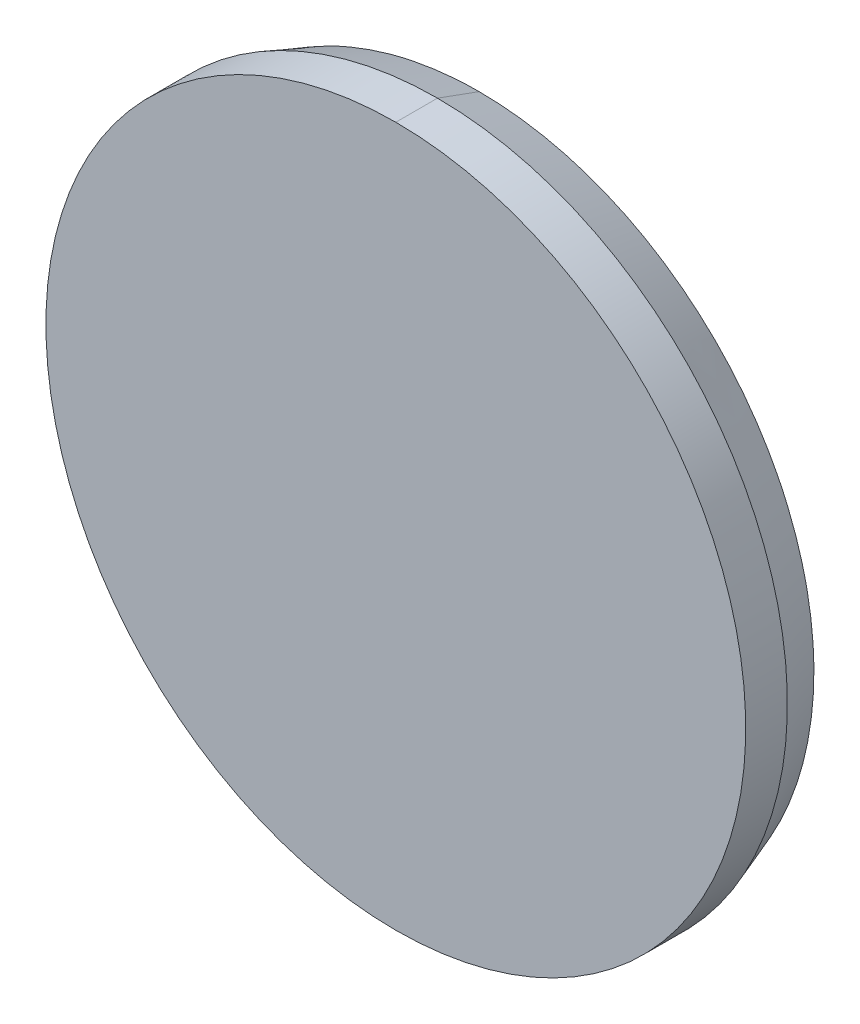
ISO-10303-21;
HEADER;
FILE_DESCRIPTION(('STEP AP214'),'2;1');
FILE_NAME('part.step','',(''),(''),'','','');
FILE_SCHEMA(('AUTOMOTIVE_DESIGN { 1 0 10303 214 1 1 1 1 }'));
ENDSEC;
DATA;
#1=APPLICATION_CONTEXT('core data for automotive mechanical design processes');
#2=APPLICATION_PROTOCOL_DEFINITION('international standard','automotive_design',2000,#1);
#3=PRODUCT_CONTEXT('',#1,'mechanical');
#4=PRODUCT('Part','Part','',(#3));
#5=PRODUCT_RELATED_PRODUCT_CATEGORY('part','',(#4));
#6=PRODUCT_DEFINITION_FORMATION('','',#4);
#7=PRODUCT_DEFINITION_CONTEXT('part definition',#1,'design');
#8=PRODUCT_DEFINITION('design','',#6,#7);
#9=PRODUCT_DEFINITION_SHAPE('','',#8);
#10=(LENGTH_UNIT() NAMED_UNIT(*) SI_UNIT(.MILLI.,.METRE.));
#11=(NAMED_UNIT(*) PLANE_ANGLE_UNIT() SI_UNIT($,.RADIAN.));
#12=(NAMED_UNIT(*) SI_UNIT($,.STERADIAN.) SOLID_ANGLE_UNIT());
#13=UNCERTAINTY_MEASURE_WITH_UNIT(LENGTH_MEASURE(1.E-05),#10,'distance_accuracy_value','');
#14=(GEOMETRIC_REPRESENTATION_CONTEXT(3) GLOBAL_UNCERTAINTY_ASSIGNED_CONTEXT((#13)) GLOBAL_UNIT_ASSIGNED_CONTEXT((#10,
#11,#12)) REPRESENTATION_CONTEXT('',''));
#15=CARTESIAN_POINT('',(0.,0.,0.));
#16=DIRECTION('',(0.,0.,1.));
#17=DIRECTION('',(1.,0.,0.));
#18=AXIS2_PLACEMENT_3D('',#15,#16,#17);
#19=CARTESIAN_POINT('',(30.25,-84.5,-139.));
#20=DIRECTION('',(0.,0.,-1.));
#21=DIRECTION('',(0.,-1.,0.));
#22=AXIS2_PLACEMENT_3D('',#19,#20,#21);
#23=PLANE('',#22);
#24=CARTESIAN_POINT('',(30.25,-84.5,-139.));
#25=DIRECTION('',(0.,0.,-1.));
#26=DIRECTION('',(0.,1.,0.));
#27=AXIS2_PLACEMENT_3D('',#24,#25,#26);
#28=CIRCLE('',#27,21.);
#29=CARTESIAN_POINT('',(30.25,-63.5,-139.));
#30=VERTEX_POINT('',#29);
#31=CARTESIAN_POINT('',(30.25,-105.5,-139.));
#32=VERTEX_POINT('',#31);
#33=EDGE_CURVE('E54',#30,#32,#28,.T.);
#34=ORIENTED_EDGE('',*,*,#33,.F.);
#35=CARTESIAN_POINT('',(30.25,-84.5,-139.));
#36=DIRECTION('',(0.,0.,-1.));
#37=DIRECTION('',(0.,-1.,0.));
#38=AXIS2_PLACEMENT_3D('',#35,#36,#37);
#39=CIRCLE('',#38,21.);
#40=EDGE_CURVE('E52',#32,#30,#39,.T.);
#41=ORIENTED_EDGE('',*,*,#40,.F.);
#42=EDGE_LOOP('',(#34,#41));
#43=FACE_BOUND('',#42,.T.);
#44=ADVANCED_FACE('F17',(#43),#23,.F.);
#45=CARTESIAN_POINT('',(30.25,-84.5,-78.375));
#46=DIRECTION('',(0.,0.,-1.));
#47=DIRECTION('',(0.,-1.,0.));
#48=AXIS2_PLACEMENT_3D('',#45,#46,#47);
#49=CYLINDRICAL_SURFACE('',#48,21.);
#50=ORIENTED_EDGE('',*,*,#33,.T.);
#51=CARTESIAN_POINT('',(30.25,-105.5,-141.5));
#52=DIRECTION('',(0.,0.,1.));
#53=VECTOR('',#52,1.);
#54=LINE('',#51,#53);
#55=CARTESIAN_POINT('',(30.25,-105.500000000001,-141.5));
#56=VERTEX_POINT('',#55);
#57=EDGE_CURVE('E74',#56,#32,#54,.T.);
#58=ORIENTED_EDGE('',*,*,#57,.F.);
#59=CARTESIAN_POINT('',(30.25,-84.5,-141.500000000001));
#60=DIRECTION('',(0.,0.,-1.));
#61=DIRECTION('',(0.,1.,0.));
#62=AXIS2_PLACEMENT_3D('',#59,#60,#61);
#63=CIRCLE('',#62,21.0000000000024);
#64=CARTESIAN_POINT('',(30.25,-63.4999999999988,-141.5));
#65=VERTEX_POINT('',#64);
#66=EDGE_CURVE('E67',#65,#56,#63,.T.);
#67=ORIENTED_EDGE('',*,*,#66,.F.);
#68=CARTESIAN_POINT('',(30.25,-63.5,-139.));
#69=DIRECTION('',(0.,0.,-1.));
#70=VECTOR('',#69,1.);
#71=LINE('',#68,#70);
#72=EDGE_CURVE('E64',#30,#65,#71,.T.);
#73=ORIENTED_EDGE('',*,*,#72,.F.);
#74=EDGE_LOOP('',(#50,#58,#67,#73));
#75=FACE_BOUND('',#74,.T.);
#76=ADVANCED_FACE('F66',(#75),#49,.T.);
#77=CARTESIAN_POINT('',(30.25,-84.5,-78.375));
#78=DIRECTION('',(0.,0.,-1.));
#79=DIRECTION('',(0.,-1.,0.));
#80=AXIS2_PLACEMENT_3D('',#77,#78,#79);
#81=CYLINDRICAL_SURFACE('',#80,21.);
#82=CARTESIAN_POINT('',(30.25,-84.5,-141.500000000001));
#83=DIRECTION('',(0.,0.,-1.));
#84=DIRECTION('',(0.,-1.,0.));
#85=AXIS2_PLACEMENT_3D('',#82,#83,#84);
#86=CIRCLE('',#85,21.0000000000024);
#87=EDGE_CURVE('E131',#56,#65,#86,.T.);
#88=ORIENTED_EDGE('',*,*,#87,.F.);
#89=ORIENTED_EDGE('',*,*,#57,.T.);
#90=ORIENTED_EDGE('',*,*,#40,.T.);
#91=ORIENTED_EDGE('',*,*,#72,.T.);
#92=EDGE_LOOP('',(#88,#89,#90,#91));
#93=FACE_BOUND('',#92,.T.);
#94=ADVANCED_FACE('F78',(#93),#81,.T.);
#95=CARTESIAN_POINT('',(30.25,-84.5,-142.75));
#96=DIRECTION('',(0.,0.,1.));
#97=DIRECTION('',(0.,1.,0.));
#98=AXIS2_PLACEMENT_3D('',#95,#96,#97);
#99=CONICAL_SURFACE('',#98,20.54503720717,0.3490658503988);
#100=ORIENTED_EDGE('',*,*,#66,.T.);
#101=CARTESIAN_POINT('',(30.25,-104.590074414333,-144.000000000012));
#102=DIRECTION('',(0.,-0.342020143325605,0.939692620785932));
#103=VECTOR('',#102,1.);
#104=LINE('',#101,#103);
#105=CARTESIAN_POINT('',(30.25,-104.590074414333,-144.000000000005));
#106=VERTEX_POINT('',#105);
#107=EDGE_CURVE('E37',#106,#56,#104,.T.);
#108=ORIENTED_EDGE('',*,*,#107,.F.);
#109=CARTESIAN_POINT('',(30.25,-64.40992558567,-144.));
#110=CARTESIAN_POINT('',(32.2284219167146,-64.40992558567,-144.));
#111=CARTESIAN_POINT('',(34.1693790868196,-64.7959507322196,-144.));
#112=CARTESIAN_POINT('',(36.1095296828903,-65.1818154641734,-144.));
#113=CARTESIAN_POINT('',(37.9381386333459,-65.9391914419719,-144.));
#114=CARTESIAN_POINT('',(39.7657313049657,-66.6961464958889,-144.));
#115=CARTESIAN_POINT('',(41.4114473237505,-67.7957136155878,-144.));
#116=CARTESIAN_POINT('',(43.0562487093553,-68.8946696331525,-144.));
#117=CARTESIAN_POINT('',(44.4558278529151,-70.2941721470849,-144.));
#118=CARTESIAN_POINT('',(45.8546291577585,-71.692896864889,-144.));
#119=CARTESIAN_POINT('',(46.9542863844122,-73.3385526762495,-144.));
#120=CARTESIAN_POINT('',(48.0533324587547,-74.9832938877436,-144.));
#121=CARTESIAN_POINT('',(48.8108085580281,-76.8118613666541,-144.));
#122=CARTESIAN_POINT('',(49.5678636776826,-78.6394125895516,-144.));
#123=CARTESIAN_POINT('',(49.9540492677804,-80.5806209131804,-144.));
#124=CARTESIAN_POINT('',(50.3400202290081,-82.520750378975,-144.));
#125=CARTESIAN_POINT('',(50.34007441433,-84.5,-144.));
#126=CARTESIAN_POINT('',(50.3401285695376,-86.4781496212056,-144.));
#127=CARTESIAN_POINT('',(49.9540492677804,-88.4193790868196,-144.));
#128=CARTESIAN_POINT('',(49.5681845358134,-90.359529682893,-144.));
#129=CARTESIAN_POINT('',(48.8108085580281,-92.1881386333459,-144.));
#130=CARTESIAN_POINT('',(48.0538535041433,-94.0157313049172,-144.));
#131=CARTESIAN_POINT('',(46.9542863844122,-95.6614473237505,-144.));
#132=CARTESIAN_POINT('',(45.8553303667979,-97.3062487094299,-144.));
#133=CARTESIAN_POINT('',(44.4558278529151,-98.7058278529151,-144.));
#134=CARTESIAN_POINT('',(43.0571031350609,-100.104629157784,-144.));
#135=CARTESIAN_POINT('',(41.4114473237505,-101.204286384412,-144.));
#136=CARTESIAN_POINT('',(39.7667061122893,-102.303332458741,-144.));
#137=CARTESIAN_POINT('',(37.9381386333459,-103.060808558028,-144.));
#138=CARTESIAN_POINT('',(36.1105874104599,-103.817863677678,-144.));
#139=CARTESIAN_POINT('',(34.1693790868196,-104.20404926778,-144.));
#140=CARTESIAN_POINT('',(32.2289772519988,-104.59007441433,-144.));
#141=CARTESIAN_POINT('',(30.25,-104.59007441433,-144.));
#142=B_SPLINE_CURVE_WITH_KNOTS('',2,(#109,#110,#111,#112,#113,#114,#115,#116,#117,#118,#119,
#120,#121,#122,#123,#124,#125,#126,#127,#128,#129,#130,#131,#132,#133,#134,#135,#136,#137,#138,
#139,#140,#141),.UNSPECIFIED.,.F.,.F.,(3,2,2,2,2,2,2,2,2,2,2,2,2,2,2,2,3),(0.,0.0625,0.125,
0.1875,0.25,0.3125,0.375,0.4375,0.5,0.5625,0.625,0.6875,0.75,0.8125,0.875,0.9375,1.),.UNSPECIFIED.);
#143=CARTESIAN_POINT('',(30.25,-64.4099255856657,-144.000000000002));
#144=VERTEX_POINT('',#143);
#145=EDGE_CURVE('E29',#144,#106,#142,.T.);
#146=ORIENTED_EDGE('',*,*,#145,.F.);
#147=CARTESIAN_POINT('',(30.25,-63.4999999999977,-141.500000000001));
#148=DIRECTION('',(0.,-0.342020143325608,-0.939692620785931));
#149=VECTOR('',#148,1.);
#150=LINE('',#147,#149);
#151=EDGE_CURVE('E136',#65,#144,#150,.T.);
#152=ORIENTED_EDGE('',*,*,#151,.F.);
#153=EDGE_LOOP('',(#100,#108,#146,#152));
#154=FACE_BOUND('',#153,.T.);
#155=ADVANCED_FACE('F97',(#154),#99,.T.);
#156=CARTESIAN_POINT('',(30.25,-84.5,-142.75));
#157=DIRECTION('',(0.,0.,1.));
#158=DIRECTION('',(0.,1.,0.));
#159=AXIS2_PLACEMENT_3D('',#156,#157,#158);
#160=CONICAL_SURFACE('',#159,20.54503720717,0.3490658503988);
#161=CARTESIAN_POINT('',(30.25,-104.59007441433,-144.));
#162=CARTESIAN_POINT('',(28.2715780831724,-104.59007441433,-144.));
#163=CARTESIAN_POINT('',(26.3306209131804,-104.20404926778,-144.));
#164=CARTESIAN_POINT('',(24.3904703170654,-103.818184535795,-144.));
#165=CARTESIAN_POINT('',(22.5618613666541,-103.060808558028,-144.));
#166=CARTESIAN_POINT('',(20.7342686950688,-102.303853504138,-144.));
#167=CARTESIAN_POINT('',(19.0885526762495,-101.204286384412,-144.));
#168=CARTESIAN_POINT('',(17.4437512906321,-100.105330366835,-144.));
#169=CARTESIAN_POINT('',(16.0441721470849,-98.7058278529151,-144.));
#170=CARTESIAN_POINT('',(14.6453708422737,-97.3071031351432,-144.));
#171=CARTESIAN_POINT('',(13.5457136155878,-95.6614473237505,-144.));
#172=CARTESIAN_POINT('',(12.4466675412124,-94.0167061122233,-144.));
#173=CARTESIAN_POINT('',(11.6891914419719,-92.1881386333459,-144.));
#174=CARTESIAN_POINT('',(10.9321363223187,-90.3605874104053,-144.));
#175=CARTESIAN_POINT('',(10.5459507322196,-88.4193790868196,-144.));
#176=CARTESIAN_POINT('',(10.1599797709981,-86.4792496211057,-144.));
#177=CARTESIAN_POINT('',(10.15992558567,-84.5,-144.));
#178=CARTESIAN_POINT('',(10.1598714304562,-82.5218503788707,-144.));
#179=CARTESIAN_POINT('',(10.5459507322196,-80.5806209131804,-144.));
#180=CARTESIAN_POINT('',(10.9318154641691,-78.6404703171503,-144.));
#181=CARTESIAN_POINT('',(11.6891914419719,-76.8118613666541,-144.));
#182=CARTESIAN_POINT('',(12.446146495856,-74.9842686950835,-144.));
#183=CARTESIAN_POINT('',(13.5457136155878,-73.3385526762495,-144.));
#184=CARTESIAN_POINT('',(14.6446696331274,-71.6937512906823,-144.));
#185=CARTESIAN_POINT('',(16.0441721470849,-70.2941721470849,-144.));
#186=CARTESIAN_POINT('',(17.442896864813,-68.8953708423051,-144.));
#187=CARTESIAN_POINT('',(19.0885526762495,-67.7957136155878,-144.));
#188=CARTESIAN_POINT('',(20.7332938877338,-66.6966675412391,-144.));
#189=CARTESIAN_POINT('',(22.5618613666541,-65.9391914419719,-144.));
#190=CARTESIAN_POINT('',(24.389412589548,-65.1821363223292,-144.));
#191=CARTESIAN_POINT('',(26.3306209131804,-64.7959507322196,-144.));
#192=CARTESIAN_POINT('',(28.2710227479582,-64.40992558567,-144.));
#193=CARTESIAN_POINT('',(30.25,-64.40992558567,-144.));
#194=B_SPLINE_CURVE_WITH_KNOTS('',2,(#161,#162,#163,#164,#165,#166,#167,#168,#169,#170,#171,
#172,#173,#174,#175,#176,#177,#178,#179,#180,#181,#182,#183,#184,#185,#186,#187,#188,#189,#190,
#191,#192,#193),.UNSPECIFIED.,.F.,.F.,(3,2,2,2,2,2,2,2,2,2,2,2,2,2,2,2,3),(0.,0.0625,0.125,
0.1875,0.25,0.3125,0.375,0.4375,0.5,0.5625,0.625,0.6875,0.75,0.8125,0.875,0.9375,1.),.UNSPECIFIED.);
#195=EDGE_CURVE('E11',#106,#144,#194,.T.);
#196=ORIENTED_EDGE('',*,*,#195,.F.);
#197=ORIENTED_EDGE('',*,*,#107,.T.);
#198=ORIENTED_EDGE('',*,*,#87,.T.);
#199=ORIENTED_EDGE('',*,*,#151,.T.);
#200=EDGE_LOOP('',(#196,#197,#198,#199));
#201=FACE_BOUND('',#200,.T.);
#202=ADVANCED_FACE('F143',(#201),#160,.T.);
#203=CARTESIAN_POINT('',(30.25,-84.5,-144.));
#204=DIRECTION('',(0.,0.,-1.));
#205=DIRECTION('',(0.,-1.,0.));
#206=AXIS2_PLACEMENT_3D('',#203,#204,#205);
#207=PLANE('',#206);
#208=ORIENTED_EDGE('',*,*,#145,.T.);
#209=ORIENTED_EDGE('',*,*,#195,.T.);
#210=EDGE_LOOP('',(#208,#209));
#211=FACE_BOUND('',#210,.T.);
#212=ADVANCED_FACE('F163',(#211),#207,.T.);
#213=CLOSED_SHELL('',(#44,#76,#94,#155,#202,#212));
#214=MANIFOLD_SOLID_BREP('B1',#213);
#215=ADVANCED_BREP_SHAPE_REPRESENTATION('',(#18,#214),#14);
#216=SHAPE_DEFINITION_REPRESENTATION(#9,#215);
ENDSEC;
END-ISO-10303-21;
